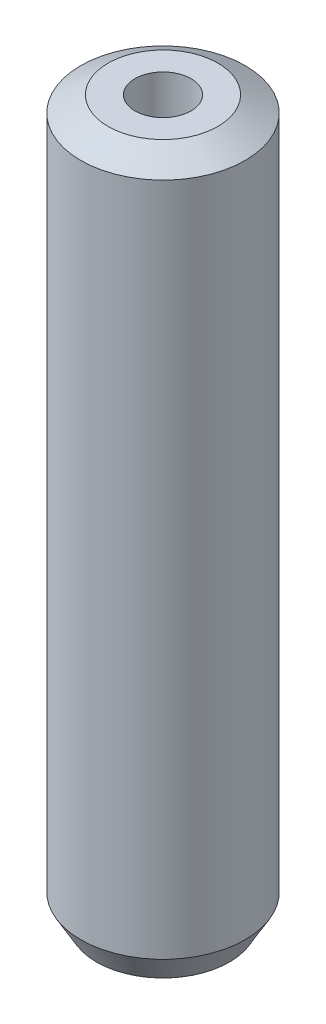
ISO-10303-21;
HEADER;
FILE_DESCRIPTION(('STEP AP214'),'2;1');
FILE_NAME('part.step','',(''),(''),'','','');
FILE_SCHEMA(('AUTOMOTIVE_DESIGN { 1 0 10303 214 1 1 1 1 }'));
ENDSEC;
DATA;
#1=APPLICATION_CONTEXT('core data for automotive mechanical design processes');
#2=APPLICATION_PROTOCOL_DEFINITION('international standard','automotive_design',2000,#1);
#3=PRODUCT_CONTEXT('',#1,'mechanical');
#4=PRODUCT('Part','Part','',(#3));
#5=PRODUCT_RELATED_PRODUCT_CATEGORY('part','',(#4));
#6=PRODUCT_DEFINITION_FORMATION('','',#4);
#7=PRODUCT_DEFINITION_CONTEXT('part definition',#1,'design');
#8=PRODUCT_DEFINITION('design','',#6,#7);
#9=PRODUCT_DEFINITION_SHAPE('','',#8);
#10=(LENGTH_UNIT() NAMED_UNIT(*) SI_UNIT(.MILLI.,.METRE.));
#11=(NAMED_UNIT(*) PLANE_ANGLE_UNIT() SI_UNIT($,.RADIAN.));
#12=(NAMED_UNIT(*) SI_UNIT($,.STERADIAN.) SOLID_ANGLE_UNIT());
#13=UNCERTAINTY_MEASURE_WITH_UNIT(LENGTH_MEASURE(1.E-05),#10,'distance_accuracy_value','');
#14=(GEOMETRIC_REPRESENTATION_CONTEXT(3) GLOBAL_UNCERTAINTY_ASSIGNED_CONTEXT((#13)) GLOBAL_UNIT_ASSIGNED_CONTEXT((#10,
#11,#12)) REPRESENTATION_CONTEXT('',''));
#15=CARTESIAN_POINT('',(0.,0.,0.));
#16=DIRECTION('',(0.,0.,1.));
#17=DIRECTION('',(1.,0.,0.));
#18=AXIS2_PLACEMENT_3D('',#15,#16,#17);
#19=CARTESIAN_POINT('',(0.,130.990104397109,0.));
#20=DIRECTION('',(0.,-1.,0.));
#21=DIRECTION('',(0.,0.,-1.));
#22=AXIS2_PLACEMENT_3D('',#19,#20,#21);
#23=CYLINDRICAL_SURFACE('',#22,15.);
#24=CARTESIAN_POINT('',(0.,128.110495806626,0.));
#25=DIRECTION('',(0.,1.,0.));
#26=DIRECTION('',(0.,0.,1.));
#27=AXIS2_PLACEMENT_3D('',#24,#25,#26);
#28=CIRCLE('',#27,15.);
#29=CARTESIAN_POINT('',(0.,128.110495806626,15.));
#30=VERTEX_POINT('',#29);
#31=EDGE_CURVE('E50',#30,#30,#28,.F.);
#32=ORIENTED_EDGE('',*,*,#31,.T.);
#33=EDGE_LOOP('',(#32));
#34=FACE_BOUND('',#33,.T.);
#35=CARTESIAN_POINT('',(0.,4.98762838462793,0.));
#36=DIRECTION('',(0.,1.,0.));
#37=DIRECTION('',(0.,0.,1.));
#38=AXIS2_PLACEMENT_3D('',#35,#36,#37);
#39=CIRCLE('',#38,15.);
#40=CARTESIAN_POINT('',(0.,4.98762838462793,15.));
#41=VERTEX_POINT('',#40);
#42=EDGE_CURVE('E51',#41,#41,#39,.T.);
#43=ORIENTED_EDGE('',*,*,#42,.T.);
#44=EDGE_LOOP('',(#43));
#45=FACE_BOUND('',#44,.T.);
#46=ADVANCED_FACE('F39',(#34,#45),#23,.T.);
#47=CARTESIAN_POINT('',(0.,130.990104397109,0.));
#48=DIRECTION('',(0.,1.,0.));
#49=DIRECTION('',(0.,0.,1.));
#50=AXIS2_PLACEMENT_3D('',#47,#48,#49);
#51=PLANE('',#50);
#52=CARTESIAN_POINT('',(0.,130.990104397109,0.));
#53=DIRECTION('',(0.,1.,0.));
#54=DIRECTION('',(0.,0.,1.));
#55=AXIS2_PLACEMENT_3D('',#52,#53,#54);
#56=CIRCLE('',#55,10.0123716153721);
#57=CARTESIAN_POINT('',(0.,130.990104397109,10.0123716153721));
#58=VERTEX_POINT('',#57);
#59=EDGE_CURVE('E54',#58,#58,#56,.T.);
#60=ORIENTED_EDGE('',*,*,#59,.T.);
#61=EDGE_LOOP('',(#60));
#62=FACE_BOUND('',#61,.T.);
#63=CARTESIAN_POINT('',(0.,130.990104397109,0.));
#64=DIRECTION('',(0.,1.,0.));
#65=DIRECTION('',(0.,0.,1.));
#66=AXIS2_PLACEMENT_3D('',#63,#64,#65);
#67=CIRCLE('',#66,5.10857234896636);
#68=CARTESIAN_POINT('',(0.,130.990104397109,5.10857234896636));
#69=VERTEX_POINT('',#68);
#70=EDGE_CURVE('E58',#69,#69,#67,.T.);
#71=ORIENTED_EDGE('',*,*,#70,.F.);
#72=EDGE_LOOP('',(#71));
#73=FACE_BOUND('',#72,.T.);
#74=ADVANCED_FACE('F69',(#62,#73),#51,.T.);
#75=CARTESIAN_POINT('',(0.,0.,0.));
#76=DIRECTION('',(0.,1.,0.));
#77=DIRECTION('',(0.,0.,1.));
#78=AXIS2_PLACEMENT_3D('',#75,#76,#77);
#79=PLANE('',#78);
#80=CARTESIAN_POINT('',(0.,0.,0.));
#81=DIRECTION('',(0.,1.,0.));
#82=DIRECTION('',(0.,0.,1.));
#83=AXIS2_PLACEMENT_3D('',#80,#81,#82);
#84=CIRCLE('',#83,12.1203914095172);
#85=CARTESIAN_POINT('',(0.,0.,12.1203914095172));
#86=VERTEX_POINT('',#85);
#87=EDGE_CURVE('E10',#86,#86,#84,.F.);
#88=ORIENTED_EDGE('',*,*,#87,.T.);
#89=EDGE_LOOP('',(#88));
#90=FACE_BOUND('',#89,.T.);
#91=CARTESIAN_POINT('',(0.,0.,0.));
#92=DIRECTION('',(0.,1.,0.));
#93=DIRECTION('',(0.,0.,1.));
#94=AXIS2_PLACEMENT_3D('',#91,#92,#93);
#95=CIRCLE('',#94,5.10857234896636);
#96=CARTESIAN_POINT('',(0.,0.,5.10857234896636));
#97=VERTEX_POINT('',#96);
#98=EDGE_CURVE('E63',#97,#97,#95,.T.);
#99=ORIENTED_EDGE('',*,*,#98,.T.);
#100=EDGE_LOOP('',(#99));
#101=FACE_BOUND('',#100,.T.);
#102=ADVANCED_FACE('F75',(#90,#101),#79,.F.);
#103=CARTESIAN_POINT('',(0.,130.990104397109,0.));
#104=DIRECTION('',(0.,-1.,0.));
#105=DIRECTION('',(0.,0.,-1.));
#106=AXIS2_PLACEMENT_3D('',#103,#104,#105);
#107=CYLINDRICAL_SURFACE('',#106,5.10857234896636);
#108=ORIENTED_EDGE('',*,*,#70,.T.);
#109=EDGE_LOOP('',(#108));
#110=FACE_BOUND('',#109,.T.);
#111=ORIENTED_EDGE('',*,*,#98,.F.);
#112=EDGE_LOOP('',(#111));
#113=FACE_BOUND('',#112,.T.);
#114=ADVANCED_FACE('F70',(#110,#113),#107,.F.);
#115=CARTESIAN_POINT('',(0.,130.990104397109,0.));
#116=DIRECTION('',(0.,-1.,0.));
#117=DIRECTION('',(0.,0.,-1.));
#118=AXIS2_PLACEMENT_3D('',#115,#116,#117);
#119=CONICAL_SURFACE('',#118,10.0123716153721,1.04719755119659);
#120=ORIENTED_EDGE('',*,*,#31,.F.);
#121=EDGE_LOOP('',(#120));
#122=FACE_BOUND('',#121,.T.);
#123=ORIENTED_EDGE('',*,*,#59,.F.);
#124=EDGE_LOOP('',(#123));
#125=FACE_BOUND('',#124,.T.);
#126=ADVANCED_FACE('F81',(#122,#125),#119,.T.);
#127=CARTESIAN_POINT('',(0.,4.98762838462793,0.));
#128=DIRECTION('',(0.,1.,0.));
#129=DIRECTION('',(0.,0.,1.));
#130=AXIS2_PLACEMENT_3D('',#127,#128,#129);
#131=CONICAL_SURFACE('',#130,15.,0.523598775598303);
#132=ORIENTED_EDGE('',*,*,#87,.F.);
#133=EDGE_LOOP('',(#132));
#134=FACE_BOUND('',#133,.T.);
#135=ORIENTED_EDGE('',*,*,#42,.F.);
#136=EDGE_LOOP('',(#135));
#137=FACE_BOUND('',#136,.T.);
#138=ADVANCED_FACE('F45',(#134,#137),#131,.T.);
#139=CLOSED_SHELL('',(#46,#74,#102,#114,#126,#138));
#140=MANIFOLD_SOLID_BREP('B2',#139);
#141=ADVANCED_BREP_SHAPE_REPRESENTATION('',(#18,#140),#14);
#142=SHAPE_DEFINITION_REPRESENTATION(#9,#141);
ENDSEC;
END-ISO-10303-21;
